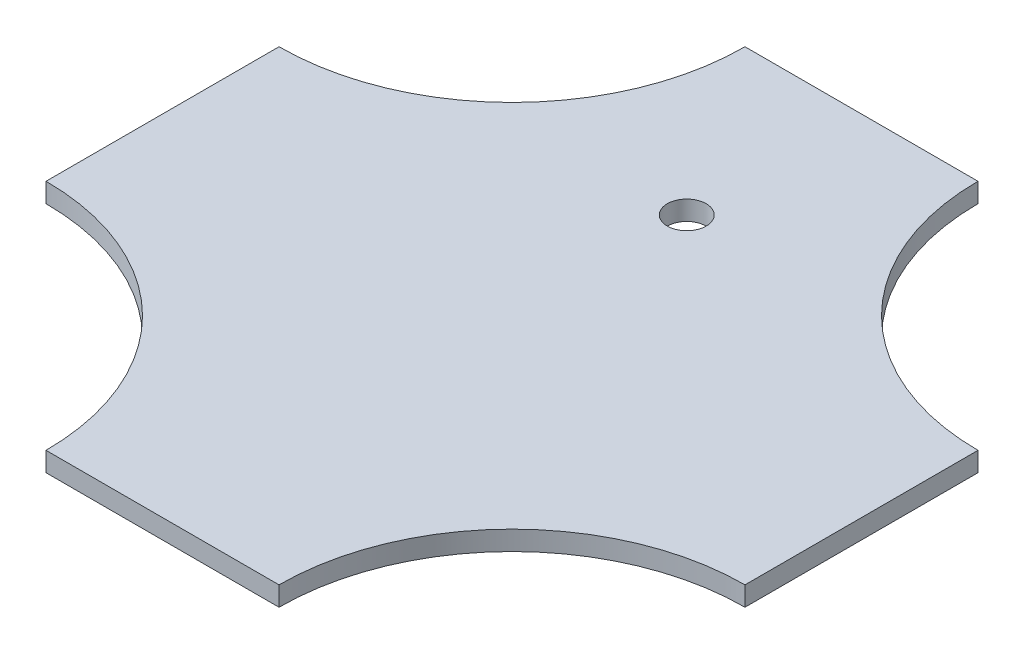
ISO-10303-21;
HEADER;
FILE_DESCRIPTION(('STEP AP214'),'2;1');
FILE_NAME('part.step','',(''),(''),'','','');
FILE_SCHEMA(('AUTOMOTIVE_DESIGN { 1 0 10303 214 1 1 1 1 }'));
ENDSEC;
DATA;
#1=APPLICATION_CONTEXT('core data for automotive mechanical design processes');
#2=APPLICATION_PROTOCOL_DEFINITION('international standard','automotive_design',2000,#1);
#3=PRODUCT_CONTEXT('',#1,'mechanical');
#4=PRODUCT('Part','Part','',(#3));
#5=PRODUCT_RELATED_PRODUCT_CATEGORY('part','',(#4));
#6=PRODUCT_DEFINITION_FORMATION('','',#4);
#7=PRODUCT_DEFINITION_CONTEXT('part definition',#1,'design');
#8=PRODUCT_DEFINITION('design','',#6,#7);
#9=PRODUCT_DEFINITION_SHAPE('','',#8);
#10=(LENGTH_UNIT() NAMED_UNIT(*) SI_UNIT(.MILLI.,.METRE.));
#11=(NAMED_UNIT(*) PLANE_ANGLE_UNIT() SI_UNIT($,.RADIAN.));
#12=(NAMED_UNIT(*) SI_UNIT($,.STERADIAN.) SOLID_ANGLE_UNIT());
#13=UNCERTAINTY_MEASURE_WITH_UNIT(LENGTH_MEASURE(1.E-05),#10,'distance_accuracy_value','');
#14=(GEOMETRIC_REPRESENTATION_CONTEXT(3) GLOBAL_UNCERTAINTY_ASSIGNED_CONTEXT((#13)) GLOBAL_UNIT_ASSIGNED_CONTEXT((#10,
#11,#12)) REPRESENTATION_CONTEXT('',''));
#15=CARTESIAN_POINT('',(0.,0.,0.));
#16=DIRECTION('',(0.,0.,1.));
#17=DIRECTION('',(1.,0.,0.));
#18=AXIS2_PLACEMENT_3D('',#15,#16,#17);
#19=CARTESIAN_POINT('',(0.,10.,180.));
#20=DIRECTION('',(0.,0.,1.));
#21=DIRECTION('',(1.,0.,0.));
#22=AXIS2_PLACEMENT_3D('',#19,#20,#21);
#23=PLANE('',#22);
#24=DIRECTION('',(-1.,0.,0.));
#25=VECTOR('',#24,1.);
#26=CARTESIAN_POINT('',(0.,0.,180.));
#27=LINE('',#26,#25);
#28=CARTESIAN_POINT('',(60.,0.,180.));
#29=VERTEX_POINT('',#28);
#30=CARTESIAN_POINT('',(-59.9999999999999,0.,180.));
#31=VERTEX_POINT('',#30);
#32=EDGE_CURVE('E146',#29,#31,#27,.T.);
#33=ORIENTED_EDGE('',*,*,#32,.F.);
#34=DIRECTION('',(0.,-1.,0.));
#35=VECTOR('',#34,1.);
#36=CARTESIAN_POINT('',(60.,10.,180.));
#37=LINE('',#36,#35);
#38=CARTESIAN_POINT('',(60.,10.,180.));
#39=VERTEX_POINT('',#38);
#40=EDGE_CURVE('E11',#39,#29,#37,.T.);
#41=ORIENTED_EDGE('',*,*,#40,.F.);
#42=DIRECTION('',(-1.,0.,0.));
#43=VECTOR('',#42,1.);
#44=CARTESIAN_POINT('',(0.,10.,180.));
#45=LINE('',#44,#43);
#46=CARTESIAN_POINT('',(-59.9999999999999,10.,180.));
#47=VERTEX_POINT('',#46);
#48=EDGE_CURVE('E166',#39,#47,#45,.T.);
#49=ORIENTED_EDGE('',*,*,#48,.T.);
#50=DIRECTION('',(0.,-1.,0.));
#51=VECTOR('',#50,1.);
#52=CARTESIAN_POINT('',(-59.9999999999999,10.,180.));
#53=LINE('',#52,#51);
#54=EDGE_CURVE('E96',#47,#31,#53,.T.);
#55=ORIENTED_EDGE('',*,*,#54,.T.);
#56=EDGE_LOOP('',(#33,#41,#49,#55));
#57=FACE_BOUND('',#56,.T.);
#58=ADVANCED_FACE('F41',(#57),#23,.T.);
#59=CARTESIAN_POINT('',(180.,10.,180.));
#60=DIRECTION('',(0.,-1.,0.));
#61=DIRECTION('',(0.,0.,-1.));
#62=AXIS2_PLACEMENT_3D('',#59,#60,#61);
#63=CYLINDRICAL_SURFACE('',#62,120.);
#64=CARTESIAN_POINT('',(180.,0.,180.));
#65=DIRECTION('',(0.,1.,0.));
#66=DIRECTION('',(0.,0.,1.));
#67=AXIS2_PLACEMENT_3D('',#64,#65,#66);
#68=CIRCLE('',#67,120.);
#69=CARTESIAN_POINT('',(180.,0.,60.0000000000001));
#70=VERTEX_POINT('',#69);
#71=EDGE_CURVE('E149',#70,#29,#68,.T.);
#72=ORIENTED_EDGE('',*,*,#71,.F.);
#73=DIRECTION('',(0.,-1.,0.));
#74=VECTOR('',#73,1.);
#75=CARTESIAN_POINT('',(180.,10.,60.0000000000001));
#76=LINE('',#75,#74);
#77=CARTESIAN_POINT('',(180.,10.,60.0000000000001));
#78=VERTEX_POINT('',#77);
#79=EDGE_CURVE('E48',#78,#70,#76,.T.);
#80=ORIENTED_EDGE('',*,*,#79,.F.);
#81=CARTESIAN_POINT('',(180.,10.,180.));
#82=DIRECTION('',(0.,1.,0.));
#83=DIRECTION('',(0.,0.,1.));
#84=AXIS2_PLACEMENT_3D('',#81,#82,#83);
#85=CIRCLE('',#84,120.);
#86=EDGE_CURVE('E192',#78,#39,#85,.T.);
#87=ORIENTED_EDGE('',*,*,#86,.T.);
#88=ORIENTED_EDGE('',*,*,#40,.T.);
#89=EDGE_LOOP('',(#72,#80,#87,#88));
#90=FACE_BOUND('',#89,.T.);
#91=ADVANCED_FACE('F183',(#90),#63,.F.);
#92=CARTESIAN_POINT('',(180.,10.,0.));
#93=DIRECTION('',(1.,0.,0.));
#94=DIRECTION('',(0.,0.,-1.));
#95=AXIS2_PLACEMENT_3D('',#92,#93,#94);
#96=PLANE('',#95);
#97=DIRECTION('',(0.,0.,1.));
#98=VECTOR('',#97,1.);
#99=CARTESIAN_POINT('',(180.,0.,0.));
#100=LINE('',#99,#98);
#101=CARTESIAN_POINT('',(180.,0.,-59.9999999999998));
#102=VERTEX_POINT('',#101);
#103=EDGE_CURVE('E153',#102,#70,#100,.T.);
#104=ORIENTED_EDGE('',*,*,#103,.F.);
#105=DIRECTION('',(0.,-1.,0.));
#106=VECTOR('',#105,1.);
#107=CARTESIAN_POINT('',(180.,10.,-59.9999999999998));
#108=LINE('',#107,#106);
#109=CARTESIAN_POINT('',(180.,10.,-59.9999999999998));
#110=VERTEX_POINT('',#109);
#111=EDGE_CURVE('E172',#110,#102,#108,.T.);
#112=ORIENTED_EDGE('',*,*,#111,.F.);
#113=DIRECTION('',(0.,0.,1.));
#114=VECTOR('',#113,1.);
#115=CARTESIAN_POINT('',(180.,10.,0.));
#116=LINE('',#115,#114);
#117=EDGE_CURVE('E179',#110,#78,#116,.T.);
#118=ORIENTED_EDGE('',*,*,#117,.T.);
#119=ORIENTED_EDGE('',*,*,#79,.T.);
#120=EDGE_LOOP('',(#104,#112,#118,#119));
#121=FACE_BOUND('',#120,.T.);
#122=ADVANCED_FACE('F177',(#121),#96,.T.);
#123=CARTESIAN_POINT('',(180.,10.,-180.));
#124=DIRECTION('',(0.,-1.,0.));
#125=DIRECTION('',(0.,0.,-1.));
#126=AXIS2_PLACEMENT_3D('',#123,#124,#125);
#127=CYLINDRICAL_SURFACE('',#126,120.);
#128=CARTESIAN_POINT('',(180.,0.,-180.));
#129=DIRECTION('',(0.,1.,0.));
#130=DIRECTION('',(0.,0.,1.));
#131=AXIS2_PLACEMENT_3D('',#128,#129,#130);
#132=CIRCLE('',#131,120.);
#133=CARTESIAN_POINT('',(60.,0.,-180.));
#134=VERTEX_POINT('',#133);
#135=EDGE_CURVE('E156',#134,#102,#132,.T.);
#136=ORIENTED_EDGE('',*,*,#135,.F.);
#137=DIRECTION('',(0.,-1.,0.));
#138=VECTOR('',#137,1.);
#139=CARTESIAN_POINT('',(60.,10.,-180.));
#140=LINE('',#139,#138);
#141=CARTESIAN_POINT('',(60.,10.,-180.));
#142=VERTEX_POINT('',#141);
#143=EDGE_CURVE('E170',#142,#134,#140,.T.);
#144=ORIENTED_EDGE('',*,*,#143,.F.);
#145=CARTESIAN_POINT('',(180.,10.,-180.));
#146=DIRECTION('',(0.,1.,0.));
#147=DIRECTION('',(0.,0.,1.));
#148=AXIS2_PLACEMENT_3D('',#145,#146,#147);
#149=CIRCLE('',#148,120.);
#150=EDGE_CURVE('E191',#142,#110,#149,.T.);
#151=ORIENTED_EDGE('',*,*,#150,.T.);
#152=ORIENTED_EDGE('',*,*,#111,.T.);
#153=EDGE_LOOP('',(#136,#144,#151,#152));
#154=FACE_BOUND('',#153,.T.);
#155=ADVANCED_FACE('F189',(#154),#127,.F.);
#156=CARTESIAN_POINT('',(0.,10.,-180.));
#157=DIRECTION('',(0.,0.,1.));
#158=DIRECTION('',(1.,0.,0.));
#159=AXIS2_PLACEMENT_3D('',#156,#157,#158);
#160=PLANE('',#159);
#161=DIRECTION('',(-1.,0.,0.));
#162=VECTOR('',#161,1.);
#163=CARTESIAN_POINT('',(0.,0.,-180.));
#164=LINE('',#163,#162);
#165=CARTESIAN_POINT('',(-59.9999999999999,0.,-180.));
#166=VERTEX_POINT('',#165);
#167=EDGE_CURVE('E159',#134,#166,#164,.T.);
#168=ORIENTED_EDGE('',*,*,#167,.T.);
#169=DIRECTION('',(0.,-1.,0.));
#170=VECTOR('',#169,1.);
#171=CARTESIAN_POINT('',(-59.9999999999999,10.,-180.));
#172=LINE('',#171,#170);
#173=CARTESIAN_POINT('',(-59.9999999999999,10.,-180.));
#174=VERTEX_POINT('',#173);
#175=EDGE_CURVE('E137',#174,#166,#172,.T.);
#176=ORIENTED_EDGE('',*,*,#175,.F.);
#177=DIRECTION('',(-1.,0.,0.));
#178=VECTOR('',#177,1.);
#179=CARTESIAN_POINT('',(0.,10.,-180.));
#180=LINE('',#179,#178);
#181=EDGE_CURVE('E125',#142,#174,#180,.T.);
#182=ORIENTED_EDGE('',*,*,#181,.F.);
#183=ORIENTED_EDGE('',*,*,#143,.T.);
#184=EDGE_LOOP('',(#168,#176,#182,#183));
#185=FACE_BOUND('',#184,.T.);
#186=ADVANCED_FACE('F295',(#185),#160,.F.);
#187=CARTESIAN_POINT('',(-180.,10.,-180.));
#188=DIRECTION('',(0.,-1.,0.));
#189=DIRECTION('',(0.,0.,-1.));
#190=AXIS2_PLACEMENT_3D('',#187,#188,#189);
#191=CYLINDRICAL_SURFACE('',#190,120.);
#192=CARTESIAN_POINT('',(-180.,0.,-180.));
#193=DIRECTION('',(0.,1.,0.));
#194=DIRECTION('',(0.,0.,1.));
#195=AXIS2_PLACEMENT_3D('',#192,#193,#194);
#196=CIRCLE('',#195,120.);
#197=CARTESIAN_POINT('',(-180.,0.,-59.9999999999998));
#198=VERTEX_POINT('',#197);
#199=EDGE_CURVE('E134',#166,#198,#196,.F.);
#200=ORIENTED_EDGE('',*,*,#199,.T.);
#201=DIRECTION('',(0.,-1.,0.));
#202=VECTOR('',#201,1.);
#203=CARTESIAN_POINT('',(-180.,10.,-59.9999999999998));
#204=LINE('',#203,#202);
#205=CARTESIAN_POINT('',(-180.,10.,-59.9999999999998));
#206=VERTEX_POINT('',#205);
#207=EDGE_CURVE('E131',#206,#198,#204,.T.);
#208=ORIENTED_EDGE('',*,*,#207,.F.);
#209=CARTESIAN_POINT('',(-180.,10.,-180.));
#210=DIRECTION('',(0.,1.,0.));
#211=DIRECTION('',(0.,0.,1.));
#212=AXIS2_PLACEMENT_3D('',#209,#210,#211);
#213=CIRCLE('',#212,120.);
#214=EDGE_CURVE('E117',#174,#206,#213,.F.);
#215=ORIENTED_EDGE('',*,*,#214,.F.);
#216=ORIENTED_EDGE('',*,*,#175,.T.);
#217=EDGE_LOOP('',(#200,#208,#215,#216));
#218=FACE_BOUND('',#217,.T.);
#219=ADVANCED_FACE('F132',(#218),#191,.F.);
#220=CARTESIAN_POINT('',(-180.,10.,0.));
#221=DIRECTION('',(1.,0.,0.));
#222=DIRECTION('',(0.,0.,-1.));
#223=AXIS2_PLACEMENT_3D('',#220,#221,#222);
#224=PLANE('',#223);
#225=DIRECTION('',(0.,0.,1.));
#226=VECTOR('',#225,1.);
#227=CARTESIAN_POINT('',(-180.,0.,0.));
#228=LINE('',#227,#226);
#229=CARTESIAN_POINT('',(-180.,0.,60.0000000000001));
#230=VERTEX_POINT('',#229);
#231=EDGE_CURVE('E162',#198,#230,#228,.T.);
#232=ORIENTED_EDGE('',*,*,#231,.T.);
#233=DIRECTION('',(0.,-1.,0.));
#234=VECTOR('',#233,1.);
#235=CARTESIAN_POINT('',(-180.,10.,60.0000000000001));
#236=LINE('',#235,#234);
#237=CARTESIAN_POINT('',(-180.,10.,60.0000000000001));
#238=VERTEX_POINT('',#237);
#239=EDGE_CURVE('E138',#238,#230,#236,.T.);
#240=ORIENTED_EDGE('',*,*,#239,.F.);
#241=DIRECTION('',(0.,0.,1.));
#242=VECTOR('',#241,1.);
#243=CARTESIAN_POINT('',(-180.,10.,0.));
#244=LINE('',#243,#242);
#245=EDGE_CURVE('E121',#206,#238,#244,.T.);
#246=ORIENTED_EDGE('',*,*,#245,.F.);
#247=ORIENTED_EDGE('',*,*,#207,.T.);
#248=EDGE_LOOP('',(#232,#240,#246,#247));
#249=FACE_BOUND('',#248,.T.);
#250=ADVANCED_FACE('F140',(#249),#224,.F.);
#251=CARTESIAN_POINT('',(-180.,10.,180.));
#252=DIRECTION('',(0.,-1.,0.));
#253=DIRECTION('',(0.,0.,-1.));
#254=AXIS2_PLACEMENT_3D('',#251,#252,#253);
#255=CYLINDRICAL_SURFACE('',#254,120.);
#256=CARTESIAN_POINT('',(-180.,0.,180.));
#257=DIRECTION('',(0.,1.,0.));
#258=DIRECTION('',(0.,0.,1.));
#259=AXIS2_PLACEMENT_3D('',#256,#257,#258);
#260=CIRCLE('',#259,120.);
#261=EDGE_CURVE('E164',#230,#31,#260,.F.);
#262=ORIENTED_EDGE('',*,*,#261,.T.);
#263=ORIENTED_EDGE('',*,*,#54,.F.);
#264=CARTESIAN_POINT('',(-180.,10.,180.));
#265=DIRECTION('',(0.,1.,0.));
#266=DIRECTION('',(0.,0.,1.));
#267=AXIS2_PLACEMENT_3D('',#264,#265,#266);
#268=CIRCLE('',#267,120.);
#269=EDGE_CURVE('E64',#238,#47,#268,.F.);
#270=ORIENTED_EDGE('',*,*,#269,.F.);
#271=ORIENTED_EDGE('',*,*,#239,.T.);
#272=EDGE_LOOP('',(#262,#263,#270,#271));
#273=FACE_BOUND('',#272,.T.);
#274=ADVANCED_FACE('F280',(#273),#255,.F.);
#275=CARTESIAN_POINT('',(0.,10.,0.));
#276=DIRECTION('',(0.,1.,0.));
#277=DIRECTION('',(0.,0.,1.));
#278=AXIS2_PLACEMENT_3D('',#275,#276,#277);
#279=PLANE('',#278);
#280=CARTESIAN_POINT('',(0.,10.,-90.));
#281=DIRECTION('',(0.,1.,0.));
#282=DIRECTION('',(0.,0.,1.));
#283=AXIS2_PLACEMENT_3D('',#280,#281,#282);
#284=CIRCLE('',#283,10.);
#285=CARTESIAN_POINT('',(0.,10.,-80.));
#286=VERTEX_POINT('',#285);
#287=EDGE_CURVE('E150',#286,#286,#284,.F.);
#288=ORIENTED_EDGE('',*,*,#287,.T.);
#289=EDGE_LOOP('',(#288));
#290=FACE_BOUND('',#289,.T.);
#291=ORIENTED_EDGE('',*,*,#48,.F.);
#292=ORIENTED_EDGE('',*,*,#86,.F.);
#293=ORIENTED_EDGE('',*,*,#117,.F.);
#294=ORIENTED_EDGE('',*,*,#150,.F.);
#295=ORIENTED_EDGE('',*,*,#181,.T.);
#296=ORIENTED_EDGE('',*,*,#214,.T.);
#297=ORIENTED_EDGE('',*,*,#245,.T.);
#298=ORIENTED_EDGE('',*,*,#269,.T.);
#299=EDGE_LOOP('',(#291,#292,#293,#294,#295,#296,#297,#298));
#300=FACE_BOUND('',#299,.T.);
#301=ADVANCED_FACE('F119',(#290,#300),#279,.T.);
#302=CARTESIAN_POINT('',(0.,0.,0.));
#303=DIRECTION('',(0.,1.,0.));
#304=DIRECTION('',(0.,0.,1.));
#305=AXIS2_PLACEMENT_3D('',#302,#303,#304);
#306=PLANE('',#305);
#307=DIRECTION('',(0.,0.,-1.));
#308=VECTOR('',#307,1.);
#309=CARTESIAN_POINT('',(-28.5,0.,0.));
#310=LINE('',#309,#308);
#311=CARTESIAN_POINT('',(-28.5,0.,-110.));
#312=VERTEX_POINT('',#311);
#313=CARTESIAN_POINT('',(-28.5,0.,-114.));
#314=VERTEX_POINT('',#313);
#315=EDGE_CURVE('E221',#312,#314,#310,.T.);
#316=ORIENTED_EDGE('',*,*,#315,.F.);
#317=DIRECTION('',(-1.,0.,0.));
#318=VECTOR('',#317,1.);
#319=CARTESIAN_POINT('',(-3.81639164714901E-13,0.,-110.));
#320=LINE('',#319,#318);
#321=CARTESIAN_POINT('',(28.5,0.,-110.));
#322=VERTEX_POINT('',#321);
#323=EDGE_CURVE('E55',#322,#312,#320,.T.);
#324=ORIENTED_EDGE('',*,*,#323,.F.);
#325=DIRECTION('',(0.,0.,-1.));
#326=VECTOR('',#325,1.);
#327=CARTESIAN_POINT('',(28.5,0.,0.));
#328=LINE('',#327,#326);
#329=CARTESIAN_POINT('',(28.5,0.,-114.));
#330=VERTEX_POINT('',#329);
#331=EDGE_CURVE('E214',#322,#330,#328,.T.);
#332=ORIENTED_EDGE('',*,*,#331,.T.);
#333=DIRECTION('',(-1.,0.,0.));
#334=VECTOR('',#333,1.);
#335=CARTESIAN_POINT('',(0.,0.,-114.));
#336=LINE('',#335,#334);
#337=EDGE_CURVE('E218',#330,#314,#336,.T.);
#338=ORIENTED_EDGE('',*,*,#337,.T.);
#339=EDGE_LOOP('',(#316,#324,#332,#338));
#340=FACE_BOUND('',#339,.T.);
#341=CARTESIAN_POINT('',(0.,0.,-90.));
#342=DIRECTION('',(0.,-1.,0.));
#343=DIRECTION('',(0.,0.,-1.));
#344=AXIS2_PLACEMENT_3D('',#341,#342,#343);
#345=CIRCLE('',#344,10.);
#346=CARTESIAN_POINT('',(0.,0.,-100.));
#347=VERTEX_POINT('',#346);
#348=EDGE_CURVE('E200',#347,#347,#345,.T.);
#349=ORIENTED_EDGE('',*,*,#348,.F.);
#350=EDGE_LOOP('',(#349));
#351=FACE_BOUND('',#350,.T.);
#352=ORIENTED_EDGE('',*,*,#32,.T.);
#353=ORIENTED_EDGE('',*,*,#261,.F.);
#354=ORIENTED_EDGE('',*,*,#231,.F.);
#355=ORIENTED_EDGE('',*,*,#199,.F.);
#356=ORIENTED_EDGE('',*,*,#167,.F.);
#357=ORIENTED_EDGE('',*,*,#135,.T.);
#358=ORIENTED_EDGE('',*,*,#103,.T.);
#359=ORIENTED_EDGE('',*,*,#71,.T.);
#360=EDGE_LOOP('',(#352,#353,#354,#355,#356,#357,#358,#359));
#361=FACE_BOUND('',#360,.T.);
#362=ADVANCED_FACE('F185',(#340,#351,#361),#306,.F.);
#363=CARTESIAN_POINT('',(0.,38.2842712474619,-90.));
#364=DIRECTION('',(0.,-1.,0.));
#365=DIRECTION('',(0.,0.,-1.));
#366=AXIS2_PLACEMENT_3D('',#363,#364,#365);
#367=CYLINDRICAL_SURFACE('',#366,10.);
#368=ORIENTED_EDGE('',*,*,#348,.T.);
#369=EDGE_LOOP('',(#368));
#370=FACE_BOUND('',#369,.T.);
#371=ORIENTED_EDGE('',*,*,#287,.F.);
#372=EDGE_LOOP('',(#371));
#373=FACE_BOUND('',#372,.T.);
#374=ADVANCED_FACE('F336',(#370,#373),#367,.F.);
#375=CARTESIAN_POINT('',(-3.81639164714901E-13,4.,-110.));
#376=DIRECTION('',(0.,0.,1.));
#377=DIRECTION('',(1.,0.,0.));
#378=AXIS2_PLACEMENT_3D('',#375,#376,#377);
#379=PLANE('',#378);
#380=ORIENTED_EDGE('',*,*,#323,.T.);
#381=DIRECTION('',(0.,-1.,0.));
#382=VECTOR('',#381,1.);
#383=CARTESIAN_POINT('',(-28.5,4.,-110.));
#384=LINE('',#383,#382);
#385=CARTESIAN_POINT('',(-28.5,4.,-110.));
#386=VERTEX_POINT('',#385);
#387=EDGE_CURVE('E204',#386,#312,#384,.T.);
#388=ORIENTED_EDGE('',*,*,#387,.F.);
#389=DIRECTION('',(-1.,0.,0.));
#390=VECTOR('',#389,1.);
#391=CARTESIAN_POINT('',(-3.81639164714901E-13,4.,-110.));
#392=LINE('',#391,#390);
#393=CARTESIAN_POINT('',(28.5,4.,-110.));
#394=VERTEX_POINT('',#393);
#395=EDGE_CURVE('E217',#394,#386,#392,.T.);
#396=ORIENTED_EDGE('',*,*,#395,.F.);
#397=DIRECTION('',(0.,-1.,0.));
#398=VECTOR('',#397,1.);
#399=CARTESIAN_POINT('',(28.5,4.,-110.));
#400=LINE('',#399,#398);
#401=EDGE_CURVE('E203',#394,#322,#400,.T.);
#402=ORIENTED_EDGE('',*,*,#401,.T.);
#403=EDGE_LOOP('',(#380,#388,#396,#402));
#404=FACE_BOUND('',#403,.T.);
#405=ADVANCED_FACE('F243',(#404),#379,.F.);
#406=CARTESIAN_POINT('',(28.5,4.,0.));
#407=DIRECTION('',(-1.,0.,0.));
#408=DIRECTION('',(0.,0.,1.));
#409=AXIS2_PLACEMENT_3D('',#406,#407,#408);
#410=PLANE('',#409);
#411=ORIENTED_EDGE('',*,*,#331,.F.);
#412=ORIENTED_EDGE('',*,*,#401,.F.);
#413=DIRECTION('',(0.,0.,-1.));
#414=VECTOR('',#413,1.);
#415=CARTESIAN_POINT('',(28.5,4.,0.));
#416=LINE('',#415,#414);
#417=CARTESIAN_POINT('',(28.5,4.,-114.));
#418=VERTEX_POINT('',#417);
#419=EDGE_CURVE('E207',#394,#418,#416,.T.);
#420=ORIENTED_EDGE('',*,*,#419,.T.);
#421=DIRECTION('',(0.,-1.,0.));
#422=VECTOR('',#421,1.);
#423=CARTESIAN_POINT('',(28.5,4.,-114.));
#424=LINE('',#423,#422);
#425=EDGE_CURVE('E210',#418,#330,#424,.T.);
#426=ORIENTED_EDGE('',*,*,#425,.T.);
#427=EDGE_LOOP('',(#411,#412,#420,#426));
#428=FACE_BOUND('',#427,.T.);
#429=ADVANCED_FACE('F256',(#428),#410,.T.);
#430=CARTESIAN_POINT('',(0.,4.,-114.));
#431=DIRECTION('',(0.,0.,1.));
#432=DIRECTION('',(1.,0.,0.));
#433=AXIS2_PLACEMENT_3D('',#430,#431,#432);
#434=PLANE('',#433);
#435=ORIENTED_EDGE('',*,*,#337,.F.);
#436=ORIENTED_EDGE('',*,*,#425,.F.);
#437=DIRECTION('',(-1.,0.,0.));
#438=VECTOR('',#437,1.);
#439=CARTESIAN_POINT('',(0.,4.,-114.));
#440=LINE('',#439,#438);
#441=CARTESIAN_POINT('',(-28.5,4.,-114.));
#442=VERTEX_POINT('',#441);
#443=EDGE_CURVE('E227',#418,#442,#440,.T.);
#444=ORIENTED_EDGE('',*,*,#443,.T.);
#445=DIRECTION('',(0.,-1.,0.));
#446=VECTOR('',#445,1.);
#447=CARTESIAN_POINT('',(-28.5,4.,-114.));
#448=LINE('',#447,#446);
#449=EDGE_CURVE('E206',#442,#314,#448,.T.);
#450=ORIENTED_EDGE('',*,*,#449,.T.);
#451=EDGE_LOOP('',(#435,#436,#444,#450));
#452=FACE_BOUND('',#451,.T.);
#453=ADVANCED_FACE('F258',(#452),#434,.T.);
#454=CARTESIAN_POINT('',(-28.5,4.,0.));
#455=DIRECTION('',(-1.,0.,0.));
#456=DIRECTION('',(0.,0.,1.));
#457=AXIS2_PLACEMENT_3D('',#454,#455,#456);
#458=PLANE('',#457);
#459=ORIENTED_EDGE('',*,*,#315,.T.);
#460=ORIENTED_EDGE('',*,*,#449,.F.);
#461=DIRECTION('',(0.,0.,-1.));
#462=VECTOR('',#461,1.);
#463=CARTESIAN_POINT('',(-28.5,4.,0.));
#464=LINE('',#463,#462);
#465=EDGE_CURVE('E230',#386,#442,#464,.T.);
#466=ORIENTED_EDGE('',*,*,#465,.F.);
#467=ORIENTED_EDGE('',*,*,#387,.T.);
#468=EDGE_LOOP('',(#459,#460,#466,#467));
#469=FACE_BOUND('',#468,.T.);
#470=ADVANCED_FACE('F264',(#469),#458,.F.);
#471=CARTESIAN_POINT('',(0.,4.,0.));
#472=DIRECTION('',(0.,-1.,0.));
#473=DIRECTION('',(0.,0.,-1.));
#474=AXIS2_PLACEMENT_3D('',#471,#472,#473);
#475=PLANE('',#474);
#476=ORIENTED_EDGE('',*,*,#395,.T.);
#477=ORIENTED_EDGE('',*,*,#465,.T.);
#478=ORIENTED_EDGE('',*,*,#443,.F.);
#479=ORIENTED_EDGE('',*,*,#419,.F.);
#480=EDGE_LOOP('',(#476,#477,#478,#479));
#481=FACE_BOUND('',#480,.T.);
#482=ADVANCED_FACE('F238',(#481),#475,.T.);
#483=CLOSED_SHELL('',(#58,#91,#122,#155,#186,#219,#250,#274,#301,#362,#374,#405,#429,#453,#470,#482));
#484=MANIFOLD_SOLID_BREP('B2',#483);
#485=ADVANCED_BREP_SHAPE_REPRESENTATION('',(#18,#484),#14);
#486=SHAPE_DEFINITION_REPRESENTATION(#9,#485);
ENDSEC;
END-ISO-10303-21;
